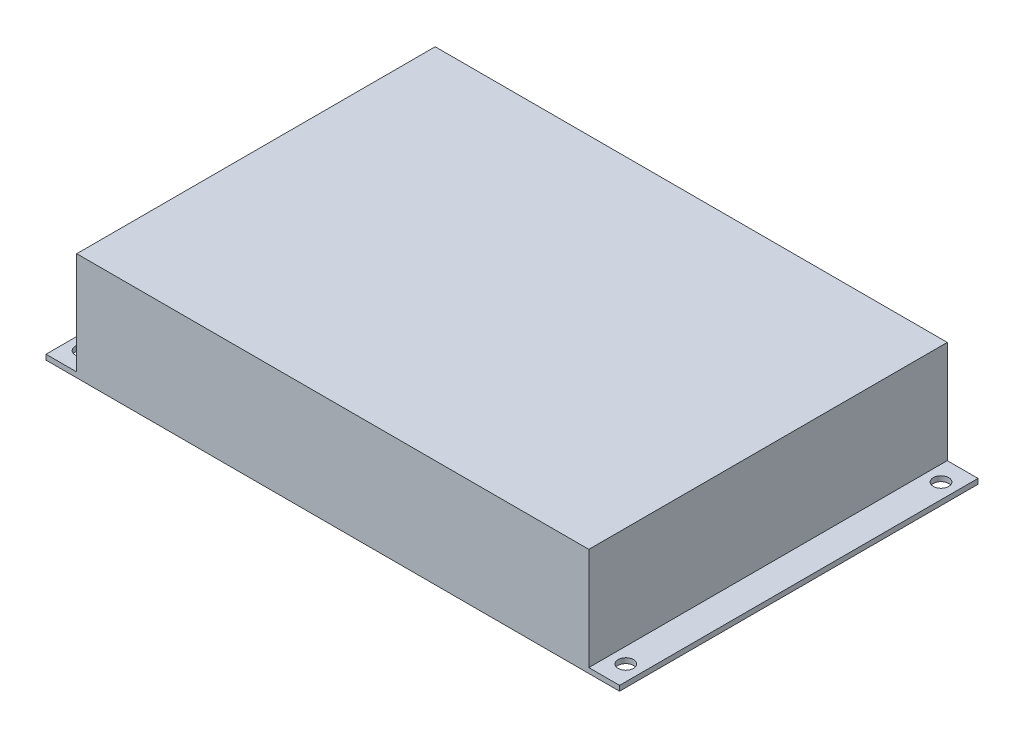
ISO-10303-21;
HEADER;
FILE_DESCRIPTION(('STEP AP214'),'2;1');
FILE_NAME('part.step','',(''),(''),'','','');
FILE_SCHEMA(('AUTOMOTIVE_DESIGN { 1 0 10303 214 1 1 1 1 }'));
ENDSEC;
DATA;
#1=APPLICATION_CONTEXT('core data for automotive mechanical design processes');
#2=APPLICATION_PROTOCOL_DEFINITION('international standard','automotive_design',2000,#1);
#3=PRODUCT_CONTEXT('',#1,'mechanical');
#4=PRODUCT('Part','Part','',(#3));
#5=PRODUCT_RELATED_PRODUCT_CATEGORY('part','',(#4));
#6=PRODUCT_DEFINITION_FORMATION('','',#4);
#7=PRODUCT_DEFINITION_CONTEXT('part definition',#1,'design');
#8=PRODUCT_DEFINITION('design','',#6,#7);
#9=PRODUCT_DEFINITION_SHAPE('','',#8);
#10=(LENGTH_UNIT() NAMED_UNIT(*) SI_UNIT(.MILLI.,.METRE.));
#11=(NAMED_UNIT(*) PLANE_ANGLE_UNIT() SI_UNIT($,.RADIAN.));
#12=(NAMED_UNIT(*) SI_UNIT($,.STERADIAN.) SOLID_ANGLE_UNIT());
#13=UNCERTAINTY_MEASURE_WITH_UNIT(LENGTH_MEASURE(1.E-05),#10,'distance_accuracy_value','');
#14=(GEOMETRIC_REPRESENTATION_CONTEXT(3) GLOBAL_UNCERTAINTY_ASSIGNED_CONTEXT((#13)) GLOBAL_UNIT_ASSIGNED_CONTEXT((#10,
#11,#12)) REPRESENTATION_CONTEXT('',''));
#15=CARTESIAN_POINT('',(0.,0.,0.));
#16=DIRECTION('',(0.,0.,1.));
#17=DIRECTION('',(1.,0.,0.));
#18=AXIS2_PLACEMENT_3D('',#15,#16,#17);
#19=CARTESIAN_POINT('',(0.,2.,0.));
#20=DIRECTION('',(0.,-1.,0.));
#21=DIRECTION('',(0.,0.,-1.));
#22=AXIS2_PLACEMENT_3D('',#19,#20,#21);
#23=PLANE('',#22);
#24=CARTESIAN_POINT('',(6.00000000000002,2.,-8.45));
#25=DIRECTION('',(0.,1.,0.));
#26=DIRECTION('',(0.,0.,1.));
#27=AXIS2_PLACEMENT_3D('',#24,#25,#26);
#28=CIRCLE('',#27,3.);
#29=CARTESIAN_POINT('',(6.00000000000002,2.,-5.45));
#30=VERTEX_POINT('',#29);
#31=EDGE_CURVE('E124',#30,#30,#28,.T.);
#32=ORIENTED_EDGE('',*,*,#31,.F.);
#33=EDGE_LOOP('',(#32));
#34=FACE_BOUND('',#33,.T.);
#35=CARTESIAN_POINT('',(6.,2.,-131.55));
#36=DIRECTION('',(0.,1.,0.));
#37=DIRECTION('',(0.,0.,1.));
#38=AXIS2_PLACEMENT_3D('',#35,#36,#37);
#39=CIRCLE('',#38,3.);
#40=CARTESIAN_POINT('',(6.,2.,-128.55));
#41=VERTEX_POINT('',#40);
#42=EDGE_CURVE('E145',#41,#41,#39,.T.);
#43=ORIENTED_EDGE('',*,*,#42,.F.);
#44=EDGE_LOOP('',(#43));
#45=FACE_BOUND('',#44,.T.);
#46=DIRECTION('',(0.,0.,1.));
#47=VECTOR('',#46,1.);
#48=CARTESIAN_POINT('',(12.,2.,-140.));
#49=LINE('',#48,#47);
#50=CARTESIAN_POINT('',(12.,2.,-140.));
#51=VERTEX_POINT('',#50);
#52=CARTESIAN_POINT('',(12.,2.,0.));
#53=VERTEX_POINT('',#52);
#54=EDGE_CURVE('E50',#51,#53,#49,.T.);
#55=ORIENTED_EDGE('',*,*,#54,.F.);
#56=DIRECTION('',(-1.,0.,0.));
#57=VECTOR('',#56,1.);
#58=CARTESIAN_POINT('',(0.,2.,-140.));
#59=LINE('',#58,#57);
#60=CARTESIAN_POINT('',(0.,2.,-140.));
#61=VERTEX_POINT('',#60);
#62=EDGE_CURVE('E160',#51,#61,#59,.T.);
#63=ORIENTED_EDGE('',*,*,#62,.T.);
#64=DIRECTION('',(0.,0.,1.));
#65=VECTOR('',#64,1.);
#66=CARTESIAN_POINT('',(0.,2.,0.));
#67=LINE('',#66,#65);
#68=CARTESIAN_POINT('',(0.,2.,0.));
#69=VERTEX_POINT('',#68);
#70=EDGE_CURVE('E151',#61,#69,#67,.T.);
#71=ORIENTED_EDGE('',*,*,#70,.T.);
#72=DIRECTION('',(1.,0.,0.));
#73=VECTOR('',#72,1.);
#74=CARTESIAN_POINT('',(0.,2.,0.));
#75=LINE('',#74,#73);
#76=EDGE_CURVE('E156',#69,#53,#75,.T.);
#77=ORIENTED_EDGE('',*,*,#76,.T.);
#78=EDGE_LOOP('',(#55,#63,#71,#77));
#79=FACE_BOUND('',#78,.T.);
#80=ADVANCED_FACE('F35',(#34,#45,#79),#23,.F.);
#81=CARTESIAN_POINT('',(218.,2.,-8.45));
#82=DIRECTION('',(0.,1.,0.));
#83=DIRECTION('',(0.,0.,1.));
#84=AXIS2_PLACEMENT_3D('',#81,#82,#83);
#85=CIRCLE('',#84,2.99999999999999);
#86=CARTESIAN_POINT('',(218.,2.,-5.45000000000001));
#87=VERTEX_POINT('',#86);
#88=EDGE_CURVE('E133',#87,#87,#85,.T.);
#89=ORIENTED_EDGE('',*,*,#88,.F.);
#90=EDGE_LOOP('',(#89));
#91=FACE_BOUND('',#90,.T.);
#92=CARTESIAN_POINT('',(218.,2.,-131.55));
#93=DIRECTION('',(0.,1.,0.));
#94=DIRECTION('',(0.,0.,1.));
#95=AXIS2_PLACEMENT_3D('',#92,#93,#94);
#96=CIRCLE('',#95,2.99999999999999);
#97=CARTESIAN_POINT('',(218.,2.,-128.55));
#98=VERTEX_POINT('',#97);
#99=EDGE_CURVE('E139',#98,#98,#96,.T.);
#100=ORIENTED_EDGE('',*,*,#99,.F.);
#101=EDGE_LOOP('',(#100));
#102=FACE_BOUND('',#101,.T.);
#103=DIRECTION('',(0.,0.,-1.));
#104=VECTOR('',#103,1.);
#105=CARTESIAN_POINT('',(212.,2.,-140.));
#106=LINE('',#105,#104);
#107=CARTESIAN_POINT('',(212.,2.,0.));
#108=VERTEX_POINT('',#107);
#109=CARTESIAN_POINT('',(212.,2.,-140.));
#110=VERTEX_POINT('',#109);
#111=EDGE_CURVE('E58',#108,#110,#106,.T.);
#112=ORIENTED_EDGE('',*,*,#111,.F.);
#113=CARTESIAN_POINT('',(224.,2.,0.));
#114=VERTEX_POINT('',#113);
#115=EDGE_CURVE('E154',#108,#114,#75,.T.);
#116=ORIENTED_EDGE('',*,*,#115,.T.);
#117=DIRECTION('',(0.,0.,-1.));
#118=VECTOR('',#117,1.);
#119=CARTESIAN_POINT('',(224.,2.,0.));
#120=LINE('',#119,#118);
#121=CARTESIAN_POINT('',(224.,2.,-140.));
#122=VERTEX_POINT('',#121);
#123=EDGE_CURVE('E158',#114,#122,#120,.T.);
#124=ORIENTED_EDGE('',*,*,#123,.T.);
#125=EDGE_CURVE('E161',#122,#110,#59,.T.);
#126=ORIENTED_EDGE('',*,*,#125,.T.);
#127=EDGE_LOOP('',(#112,#116,#124,#126));
#128=FACE_BOUND('',#127,.T.);
#129=ADVANCED_FACE('F204',(#91,#102,#128),#23,.F.);
#130=CARTESIAN_POINT('',(0.,0.,0.));
#131=DIRECTION('',(0.,-1.,0.));
#132=DIRECTION('',(0.,0.,-1.));
#133=AXIS2_PLACEMENT_3D('',#130,#131,#132);
#134=PLANE('',#133);
#135=CARTESIAN_POINT('',(218.,0.,-8.45));
#136=DIRECTION('',(0.,1.,0.));
#137=DIRECTION('',(0.,0.,1.));
#138=AXIS2_PLACEMENT_3D('',#135,#136,#137);
#139=CIRCLE('',#138,2.99999999999999);
#140=CARTESIAN_POINT('',(218.,0.,-5.45000000000001));
#141=VERTEX_POINT('',#140);
#142=EDGE_CURVE('E131',#141,#141,#139,.T.);
#143=ORIENTED_EDGE('',*,*,#142,.T.);
#144=EDGE_LOOP('',(#143));
#145=FACE_BOUND('',#144,.T.);
#146=CARTESIAN_POINT('',(6.,0.,-131.55));
#147=DIRECTION('',(0.,1.,0.));
#148=DIRECTION('',(0.,0.,1.));
#149=AXIS2_PLACEMENT_3D('',#146,#147,#148);
#150=CIRCLE('',#149,3.);
#151=CARTESIAN_POINT('',(6.,0.,-128.55));
#152=VERTEX_POINT('',#151);
#153=EDGE_CURVE('E142',#152,#152,#150,.T.);
#154=ORIENTED_EDGE('',*,*,#153,.T.);
#155=EDGE_LOOP('',(#154));
#156=FACE_BOUND('',#155,.T.);
#157=DIRECTION('',(0.,0.,1.));
#158=VECTOR('',#157,1.);
#159=CARTESIAN_POINT('',(0.,0.,0.));
#160=LINE('',#159,#158);
#161=CARTESIAN_POINT('',(0.,0.,-140.));
#162=VERTEX_POINT('',#161);
#163=CARTESIAN_POINT('',(0.,0.,0.));
#164=VERTEX_POINT('',#163);
#165=EDGE_CURVE('E148',#162,#164,#160,.T.);
#166=ORIENTED_EDGE('',*,*,#165,.F.);
#167=DIRECTION('',(-1.,0.,0.));
#168=VECTOR('',#167,1.);
#169=CARTESIAN_POINT('',(0.,0.,-140.));
#170=LINE('',#169,#168);
#171=CARTESIAN_POINT('',(224.,0.,-140.));
#172=VERTEX_POINT('',#171);
#173=EDGE_CURVE('E155',#172,#162,#170,.T.);
#174=ORIENTED_EDGE('',*,*,#173,.F.);
#175=DIRECTION('',(0.,0.,-1.));
#176=VECTOR('',#175,1.);
#177=CARTESIAN_POINT('',(224.,0.,0.));
#178=LINE('',#177,#176);
#179=CARTESIAN_POINT('',(224.,0.,0.));
#180=VERTEX_POINT('',#179);
#181=EDGE_CURVE('E168',#180,#172,#178,.T.);
#182=ORIENTED_EDGE('',*,*,#181,.F.);
#183=DIRECTION('',(1.,0.,0.));
#184=VECTOR('',#183,1.);
#185=CARTESIAN_POINT('',(0.,0.,0.));
#186=LINE('',#185,#184);
#187=EDGE_CURVE('E166',#164,#180,#186,.T.);
#188=ORIENTED_EDGE('',*,*,#187,.F.);
#189=EDGE_LOOP('',(#166,#174,#182,#188));
#190=FACE_BOUND('',#189,.T.);
#191=CARTESIAN_POINT('',(218.,0.,-131.55));
#192=DIRECTION('',(0.,1.,0.));
#193=DIRECTION('',(0.,0.,1.));
#194=AXIS2_PLACEMENT_3D('',#191,#192,#193);
#195=CIRCLE('',#194,2.99999999999999);
#196=CARTESIAN_POINT('',(218.,0.,-128.55));
#197=VERTEX_POINT('',#196);
#198=EDGE_CURVE('E136',#197,#197,#195,.T.);
#199=ORIENTED_EDGE('',*,*,#198,.T.);
#200=EDGE_LOOP('',(#199));
#201=FACE_BOUND('',#200,.T.);
#202=CARTESIAN_POINT('',(6.00000000000002,0.,-8.45));
#203=DIRECTION('',(0.,1.,0.));
#204=DIRECTION('',(0.,0.,1.));
#205=AXIS2_PLACEMENT_3D('',#202,#203,#204);
#206=CIRCLE('',#205,3.);
#207=CARTESIAN_POINT('',(6.00000000000002,0.,-5.45));
#208=VERTEX_POINT('',#207);
#209=EDGE_CURVE('E121',#208,#208,#206,.T.);
#210=ORIENTED_EDGE('',*,*,#209,.T.);
#211=EDGE_LOOP('',(#210));
#212=FACE_BOUND('',#211,.T.);
#213=ADVANCED_FACE('F185',(#145,#156,#190,#201,#212),#134,.T.);
#214=CARTESIAN_POINT('',(0.,2.,0.));
#215=DIRECTION('',(1.,0.,0.));
#216=DIRECTION('',(0.,0.,-1.));
#217=AXIS2_PLACEMENT_3D('',#214,#215,#216);
#218=PLANE('',#217);
#219=ORIENTED_EDGE('',*,*,#165,.T.);
#220=DIRECTION('',(0.,-1.,0.));
#221=VECTOR('',#220,1.);
#222=CARTESIAN_POINT('',(0.,2.,0.));
#223=LINE('',#222,#221);
#224=EDGE_CURVE('E11',#69,#164,#223,.T.);
#225=ORIENTED_EDGE('',*,*,#224,.F.);
#226=ORIENTED_EDGE('',*,*,#70,.F.);
#227=DIRECTION('',(0.,-1.,0.));
#228=VECTOR('',#227,1.);
#229=CARTESIAN_POINT('',(0.,2.,-140.));
#230=LINE('',#229,#228);
#231=EDGE_CURVE('E163',#61,#162,#230,.T.);
#232=ORIENTED_EDGE('',*,*,#231,.T.);
#233=EDGE_LOOP('',(#219,#225,#226,#232));
#234=FACE_BOUND('',#233,.T.);
#235=ADVANCED_FACE('F37',(#234),#218,.F.);
#236=CARTESIAN_POINT('',(0.,2.,0.));
#237=DIRECTION('',(0.,0.,-1.));
#238=DIRECTION('',(-1.,0.,0.));
#239=AXIS2_PLACEMENT_3D('',#236,#237,#238);
#240=PLANE('',#239);
#241=ORIENTED_EDGE('',*,*,#187,.T.);
#242=DIRECTION('',(0.,-1.,0.));
#243=VECTOR('',#242,1.);
#244=CARTESIAN_POINT('',(224.,2.,0.));
#245=LINE('',#244,#243);
#246=EDGE_CURVE('E43',#114,#180,#245,.T.);
#247=ORIENTED_EDGE('',*,*,#246,.F.);
#248=ORIENTED_EDGE('',*,*,#115,.F.);
#249=DIRECTION('',(0.,-1.,0.));
#250=VECTOR('',#249,1.);
#251=CARTESIAN_POINT('',(212.,42.,0.));
#252=LINE('',#251,#250);
#253=CARTESIAN_POINT('',(212.,42.,0.));
#254=VERTEX_POINT('',#253);
#255=EDGE_CURVE('E106',#254,#108,#252,.T.);
#256=ORIENTED_EDGE('',*,*,#255,.F.);
#257=DIRECTION('',(1.,0.,0.));
#258=VECTOR('',#257,1.);
#259=CARTESIAN_POINT('',(12.,42.,0.));
#260=LINE('',#259,#258);
#261=CARTESIAN_POINT('',(12.,42.,0.));
#262=VERTEX_POINT('',#261);
#263=EDGE_CURVE('E100',#262,#254,#260,.T.);
#264=ORIENTED_EDGE('',*,*,#263,.F.);
#265=DIRECTION('',(0.,-1.,0.));
#266=VECTOR('',#265,1.);
#267=CARTESIAN_POINT('',(12.,42.,0.));
#268=LINE('',#267,#266);
#269=EDGE_CURVE('E104',#262,#53,#268,.T.);
#270=ORIENTED_EDGE('',*,*,#269,.T.);
#271=ORIENTED_EDGE('',*,*,#76,.F.);
#272=ORIENTED_EDGE('',*,*,#224,.T.);
#273=EDGE_LOOP('',(#241,#247,#248,#256,#264,#270,#271,#272));
#274=FACE_BOUND('',#273,.T.);
#275=ADVANCED_FACE('F102',(#274),#240,.F.);
#276=CARTESIAN_POINT('',(224.,2.,0.));
#277=DIRECTION('',(-1.,0.,0.));
#278=DIRECTION('',(0.,0.,1.));
#279=AXIS2_PLACEMENT_3D('',#276,#277,#278);
#280=PLANE('',#279);
#281=ORIENTED_EDGE('',*,*,#181,.T.);
#282=DIRECTION('',(0.,-1.,0.));
#283=VECTOR('',#282,1.);
#284=CARTESIAN_POINT('',(224.,2.,-140.));
#285=LINE('',#284,#283);
#286=EDGE_CURVE('E173',#122,#172,#285,.T.);
#287=ORIENTED_EDGE('',*,*,#286,.F.);
#288=ORIENTED_EDGE('',*,*,#123,.F.);
#289=ORIENTED_EDGE('',*,*,#246,.T.);
#290=EDGE_LOOP('',(#281,#287,#288,#289));
#291=FACE_BOUND('',#290,.T.);
#292=ADVANCED_FACE('F180',(#291),#280,.F.);
#293=CARTESIAN_POINT('',(0.,2.,-140.));
#294=DIRECTION('',(0.,0.,1.));
#295=DIRECTION('',(1.,0.,0.));
#296=AXIS2_PLACEMENT_3D('',#293,#294,#295);
#297=PLANE('',#296);
#298=ORIENTED_EDGE('',*,*,#173,.T.);
#299=ORIENTED_EDGE('',*,*,#231,.F.);
#300=ORIENTED_EDGE('',*,*,#62,.F.);
#301=DIRECTION('',(0.,-1.,0.));
#302=VECTOR('',#301,1.);
#303=CARTESIAN_POINT('',(12.,42.,-140.));
#304=LINE('',#303,#302);
#305=CARTESIAN_POINT('',(12.,42.,-140.));
#306=VERTEX_POINT('',#305);
#307=EDGE_CURVE('E194',#306,#51,#304,.T.);
#308=ORIENTED_EDGE('',*,*,#307,.F.);
#309=DIRECTION('',(-1.,0.,0.));
#310=VECTOR('',#309,1.);
#311=CARTESIAN_POINT('',(12.,42.,-140.));
#312=LINE('',#311,#310);
#313=CARTESIAN_POINT('',(212.,42.,-140.));
#314=VERTEX_POINT('',#313);
#315=EDGE_CURVE('E115',#314,#306,#312,.T.);
#316=ORIENTED_EDGE('',*,*,#315,.F.);
#317=DIRECTION('',(0.,-1.,0.));
#318=VECTOR('',#317,1.);
#319=CARTESIAN_POINT('',(212.,42.,-140.));
#320=LINE('',#319,#318);
#321=EDGE_CURVE('E126',#314,#110,#320,.T.);
#322=ORIENTED_EDGE('',*,*,#321,.T.);
#323=ORIENTED_EDGE('',*,*,#125,.F.);
#324=ORIENTED_EDGE('',*,*,#286,.T.);
#325=EDGE_LOOP('',(#298,#299,#300,#308,#316,#322,#323,#324));
#326=FACE_BOUND('',#325,.T.);
#327=ADVANCED_FACE('F189',(#326),#297,.F.);
#328=CARTESIAN_POINT('',(6.,2.,-131.55));
#329=DIRECTION('',(0.,-1.,0.));
#330=DIRECTION('',(0.,0.,-1.));
#331=AXIS2_PLACEMENT_3D('',#328,#329,#330);
#332=CYLINDRICAL_SURFACE('',#331,3.);
#333=ORIENTED_EDGE('',*,*,#42,.T.);
#334=EDGE_LOOP('',(#333));
#335=FACE_BOUND('',#334,.T.);
#336=ORIENTED_EDGE('',*,*,#153,.F.);
#337=EDGE_LOOP('',(#336));
#338=FACE_BOUND('',#337,.T.);
#339=ADVANCED_FACE('F218',(#335,#338),#332,.F.);
#340=CARTESIAN_POINT('',(218.,2.,-131.55));
#341=DIRECTION('',(0.,-1.,0.));
#342=DIRECTION('',(0.,0.,-1.));
#343=AXIS2_PLACEMENT_3D('',#340,#341,#342);
#344=CYLINDRICAL_SURFACE('',#343,2.99999999999999);
#345=ORIENTED_EDGE('',*,*,#99,.T.);
#346=EDGE_LOOP('',(#345));
#347=FACE_BOUND('',#346,.T.);
#348=ORIENTED_EDGE('',*,*,#198,.F.);
#349=EDGE_LOOP('',(#348));
#350=FACE_BOUND('',#349,.T.);
#351=ADVANCED_FACE('F266',(#347,#350),#344,.F.);
#352=CARTESIAN_POINT('',(218.,2.,-8.45));
#353=DIRECTION('',(0.,-1.,0.));
#354=DIRECTION('',(0.,0.,-1.));
#355=AXIS2_PLACEMENT_3D('',#352,#353,#354);
#356=CYLINDRICAL_SURFACE('',#355,2.99999999999999);
#357=ORIENTED_EDGE('',*,*,#88,.T.);
#358=EDGE_LOOP('',(#357));
#359=FACE_BOUND('',#358,.T.);
#360=ORIENTED_EDGE('',*,*,#142,.F.);
#361=EDGE_LOOP('',(#360));
#362=FACE_BOUND('',#361,.T.);
#363=ADVANCED_FACE('F274',(#359,#362),#356,.F.);
#364=CARTESIAN_POINT('',(6.00000000000002,2.,-8.45));
#365=DIRECTION('',(0.,-1.,0.));
#366=DIRECTION('',(0.,0.,-1.));
#367=AXIS2_PLACEMENT_3D('',#364,#365,#366);
#368=CYLINDRICAL_SURFACE('',#367,3.);
#369=ORIENTED_EDGE('',*,*,#31,.T.);
#370=EDGE_LOOP('',(#369));
#371=FACE_BOUND('',#370,.T.);
#372=ORIENTED_EDGE('',*,*,#209,.F.);
#373=EDGE_LOOP('',(#372));
#374=FACE_BOUND('',#373,.T.);
#375=ADVANCED_FACE('F282',(#371,#374),#368,.F.);
#376=CARTESIAN_POINT('',(12.,42.,-140.));
#377=DIRECTION('',(1.,0.,0.));
#378=DIRECTION('',(0.,0.,-1.));
#379=AXIS2_PLACEMENT_3D('',#376,#377,#378);
#380=PLANE('',#379);
#381=ORIENTED_EDGE('',*,*,#54,.T.);
#382=ORIENTED_EDGE('',*,*,#269,.F.);
#383=DIRECTION('',(0.,0.,1.));
#384=VECTOR('',#383,1.);
#385=CARTESIAN_POINT('',(12.,42.,-140.));
#386=LINE('',#385,#384);
#387=EDGE_CURVE('E110',#306,#262,#386,.T.);
#388=ORIENTED_EDGE('',*,*,#387,.F.);
#389=ORIENTED_EDGE('',*,*,#307,.T.);
#390=EDGE_LOOP('',(#381,#382,#388,#389));
#391=FACE_BOUND('',#390,.T.);
#392=ADVANCED_FACE('F120',(#391),#380,.F.);
#393=CARTESIAN_POINT('',(212.,42.,-140.));
#394=DIRECTION('',(-1.,0.,0.));
#395=DIRECTION('',(0.,0.,1.));
#396=AXIS2_PLACEMENT_3D('',#393,#394,#395);
#397=PLANE('',#396);
#398=ORIENTED_EDGE('',*,*,#111,.T.);
#399=ORIENTED_EDGE('',*,*,#321,.F.);
#400=DIRECTION('',(0.,0.,-1.));
#401=VECTOR('',#400,1.);
#402=CARTESIAN_POINT('',(212.,42.,-140.));
#403=LINE('',#402,#401);
#404=EDGE_CURVE('E109',#254,#314,#403,.T.);
#405=ORIENTED_EDGE('',*,*,#404,.F.);
#406=ORIENTED_EDGE('',*,*,#255,.T.);
#407=EDGE_LOOP('',(#398,#399,#405,#406));
#408=FACE_BOUND('',#407,.T.);
#409=ADVANCED_FACE('F203',(#408),#397,.F.);
#410=CARTESIAN_POINT('',(0.,42.,0.));
#411=DIRECTION('',(0.,1.,0.));
#412=DIRECTION('',(0.,0.,1.));
#413=AXIS2_PLACEMENT_3D('',#410,#411,#412);
#414=PLANE('',#413);
#415=ORIENTED_EDGE('',*,*,#387,.T.);
#416=ORIENTED_EDGE('',*,*,#263,.T.);
#417=ORIENTED_EDGE('',*,*,#404,.T.);
#418=ORIENTED_EDGE('',*,*,#315,.T.);
#419=EDGE_LOOP('',(#415,#416,#417,#418));
#420=FACE_BOUND('',#419,.T.);
#421=ADVANCED_FACE('F113',(#420),#414,.T.);
#422=CLOSED_SHELL('',(#80,#129,#213,#235,#275,#292,#327,#339,#351,#363,#375,#392,#409,#421));
#423=MANIFOLD_SOLID_BREP('B2',#422);
#424=ADVANCED_BREP_SHAPE_REPRESENTATION('',(#18,#423),#14);
#425=SHAPE_DEFINITION_REPRESENTATION(#9,#424);
ENDSEC;
END-ISO-10303-21;
